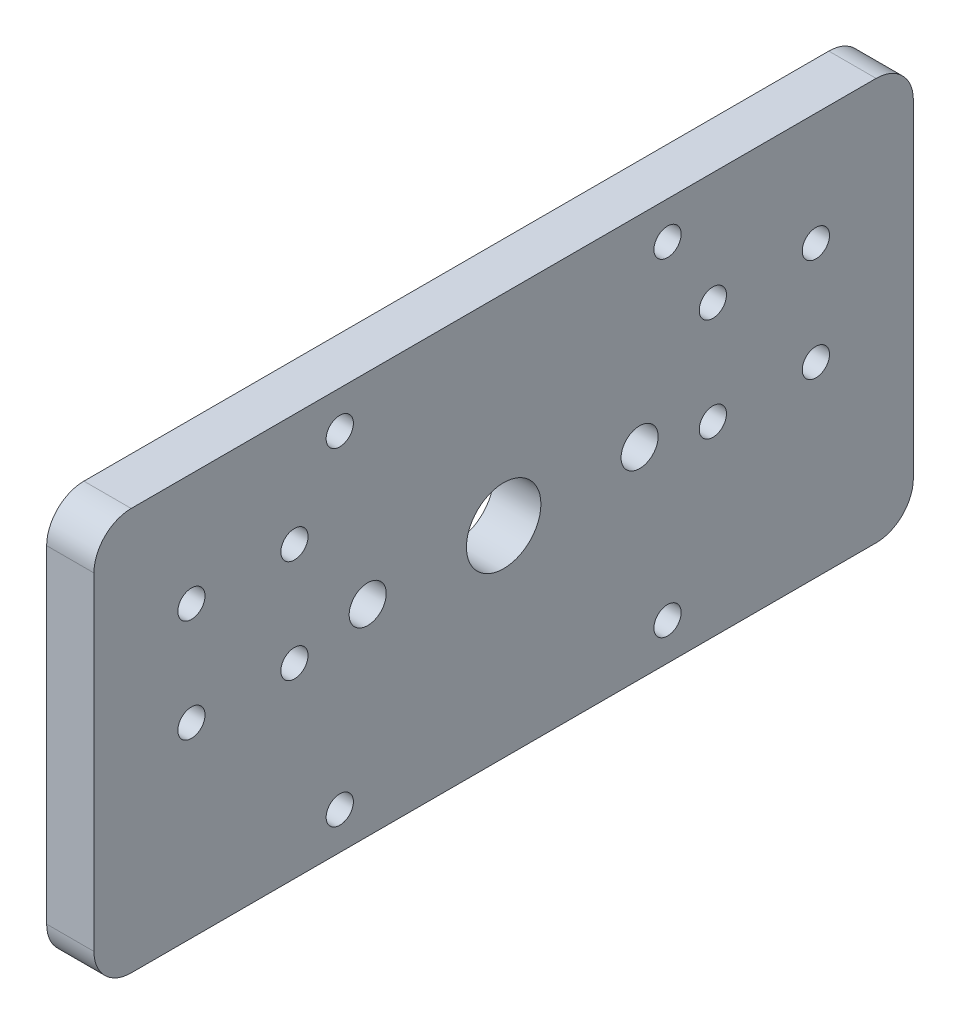
ISO-10303-21;
HEADER;
FILE_DESCRIPTION(('STEP AP214'),'2;1');
FILE_NAME('part.step','',(''),(''),'','','');
FILE_SCHEMA(('AUTOMOTIVE_DESIGN { 1 0 10303 214 1 1 1 1 }'));
ENDSEC;
DATA;
#1=APPLICATION_CONTEXT('core data for automotive mechanical design processes');
#2=APPLICATION_PROTOCOL_DEFINITION('international standard','automotive_design',2000,#1);
#3=PRODUCT_CONTEXT('',#1,'mechanical');
#4=PRODUCT('Part','Part','',(#3));
#5=PRODUCT_RELATED_PRODUCT_CATEGORY('part','',(#4));
#6=PRODUCT_DEFINITION_FORMATION('','',#4);
#7=PRODUCT_DEFINITION_CONTEXT('part definition',#1,'design');
#8=PRODUCT_DEFINITION('design','',#6,#7);
#9=PRODUCT_DEFINITION_SHAPE('','',#8);
#10=(LENGTH_UNIT() NAMED_UNIT(*) SI_UNIT(.MILLI.,.METRE.));
#11=(NAMED_UNIT(*) PLANE_ANGLE_UNIT() SI_UNIT($,.RADIAN.));
#12=(NAMED_UNIT(*) SI_UNIT($,.STERADIAN.) SOLID_ANGLE_UNIT());
#13=UNCERTAINTY_MEASURE_WITH_UNIT(LENGTH_MEASURE(1.E-05),#10,'distance_accuracy_value','');
#14=(GEOMETRIC_REPRESENTATION_CONTEXT(3) GLOBAL_UNCERTAINTY_ASSIGNED_CONTEXT((#13)) GLOBAL_UNIT_ASSIGNED_CONTEXT((#10,
#11,#12)) REPRESENTATION_CONTEXT('',''));
#15=CARTESIAN_POINT('',(0.,0.,0.));
#16=DIRECTION('',(0.,0.,1.));
#17=DIRECTION('',(1.,0.,0.));
#18=AXIS2_PLACEMENT_3D('',#15,#16,#17);
#19=CARTESIAN_POINT('',(6.35,-27.,-55.));
#20=DIRECTION('',(0.,0.,1.));
#21=DIRECTION('',(1.,0.,0.));
#22=AXIS2_PLACEMENT_3D('',#19,#20,#21);
#23=PLANE('',#22);
#24=DIRECTION('',(0.,1.,0.));
#25=VECTOR('',#24,1.);
#26=CARTESIAN_POINT('',(6.35,-27.,-55.));
#27=LINE('',#26,#25);
#28=CARTESIAN_POINT('',(6.35,-22.,-55.));
#29=VERTEX_POINT('',#28);
#30=CARTESIAN_POINT('',(6.35,22.,-55.));
#31=VERTEX_POINT('',#30);
#32=EDGE_CURVE('E118',#29,#31,#27,.T.);
#33=ORIENTED_EDGE('',*,*,#32,.F.);
#34=DIRECTION('',(-1.,0.,0.));
#35=VECTOR('',#34,1.);
#36=CARTESIAN_POINT('',(6.35,-22.,-55.));
#37=LINE('',#36,#35);
#38=CARTESIAN_POINT('',(0.,-22.,-55.));
#39=VERTEX_POINT('',#38);
#40=EDGE_CURVE('E103',#29,#39,#37,.T.);
#41=ORIENTED_EDGE('',*,*,#40,.T.);
#42=DIRECTION('',(0.,1.,0.));
#43=VECTOR('',#42,1.);
#44=CARTESIAN_POINT('',(0.,-27.,-55.));
#45=LINE('',#44,#43);
#46=CARTESIAN_POINT('',(0.,22.,-55.));
#47=VERTEX_POINT('',#46);
#48=EDGE_CURVE('E115',#39,#47,#45,.T.);
#49=ORIENTED_EDGE('',*,*,#48,.T.);
#50=DIRECTION('',(-1.,0.,0.));
#51=VECTOR('',#50,1.);
#52=CARTESIAN_POINT('',(6.35,22.,-55.));
#53=LINE('',#52,#51);
#54=EDGE_CURVE('E120',#47,#31,#53,.F.);
#55=ORIENTED_EDGE('',*,*,#54,.T.);
#56=EDGE_LOOP('',(#33,#41,#49,#55));
#57=FACE_BOUND('',#56,.T.);
#58=ADVANCED_FACE('F32',(#57),#23,.F.);
#59=CARTESIAN_POINT('',(6.35,27.,55.));
#60=DIRECTION('',(0.,-1.,0.));
#61=DIRECTION('',(0.,0.,-1.));
#62=AXIS2_PLACEMENT_3D('',#59,#60,#61);
#63=PLANE('',#62);
#64=DIRECTION('',(0.,0.,1.));
#65=VECTOR('',#64,1.);
#66=CARTESIAN_POINT('',(6.35,27.,55.));
#67=LINE('',#66,#65);
#68=CARTESIAN_POINT('',(6.35,27.,-50.));
#69=VERTEX_POINT('',#68);
#70=CARTESIAN_POINT('',(6.35,27.,50.));
#71=VERTEX_POINT('',#70);
#72=EDGE_CURVE('E162',#69,#71,#67,.T.);
#73=ORIENTED_EDGE('',*,*,#72,.F.);
#74=DIRECTION('',(-1.,0.,0.));
#75=VECTOR('',#74,1.);
#76=CARTESIAN_POINT('',(6.35,27.,-50.));
#77=LINE('',#76,#75);
#78=CARTESIAN_POINT('',(0.,27.,-50.));
#79=VERTEX_POINT('',#78);
#80=EDGE_CURVE('E11',#69,#79,#77,.T.);
#81=ORIENTED_EDGE('',*,*,#80,.T.);
#82=DIRECTION('',(0.,0.,1.));
#83=VECTOR('',#82,1.);
#84=CARTESIAN_POINT('',(0.,27.,55.));
#85=LINE('',#84,#83);
#86=CARTESIAN_POINT('',(0.,27.,50.));
#87=VERTEX_POINT('',#86);
#88=EDGE_CURVE('E125',#79,#87,#85,.T.);
#89=ORIENTED_EDGE('',*,*,#88,.T.);
#90=DIRECTION('',(-1.,0.,0.));
#91=VECTOR('',#90,1.);
#92=CARTESIAN_POINT('',(6.35,27.,50.));
#93=LINE('',#92,#91);
#94=EDGE_CURVE('E40',#87,#71,#93,.F.);
#95=ORIENTED_EDGE('',*,*,#94,.T.);
#96=EDGE_LOOP('',(#73,#81,#89,#95));
#97=FACE_BOUND('',#96,.T.);
#98=ADVANCED_FACE('F161',(#97),#63,.F.);
#99=CARTESIAN_POINT('',(6.35,-27.,55.));
#100=DIRECTION('',(0.,0.,-1.));
#101=DIRECTION('',(-1.,0.,0.));
#102=AXIS2_PLACEMENT_3D('',#99,#100,#101);
#103=PLANE('',#102);
#104=DIRECTION('',(0.,-1.,0.));
#105=VECTOR('',#104,1.);
#106=CARTESIAN_POINT('',(0.,-27.,55.));
#107=LINE('',#106,#105);
#108=CARTESIAN_POINT('',(0.,22.,55.));
#109=VERTEX_POINT('',#108);
#110=CARTESIAN_POINT('',(0.,-22.,55.));
#111=VERTEX_POINT('',#110);
#112=EDGE_CURVE('E129',#109,#111,#107,.T.);
#113=ORIENTED_EDGE('',*,*,#112,.T.);
#114=DIRECTION('',(-1.,0.,0.));
#115=VECTOR('',#114,1.);
#116=CARTESIAN_POINT('',(6.35,-22.,55.));
#117=LINE('',#116,#115);
#118=CARTESIAN_POINT('',(6.35,-22.,55.));
#119=VERTEX_POINT('',#118);
#120=EDGE_CURVE('E47',#111,#119,#117,.F.);
#121=ORIENTED_EDGE('',*,*,#120,.T.);
#122=DIRECTION('',(0.,-1.,0.));
#123=VECTOR('',#122,1.);
#124=CARTESIAN_POINT('',(6.35,-27.,55.));
#125=LINE('',#124,#123);
#126=CARTESIAN_POINT('',(6.35,22.,55.));
#127=VERTEX_POINT('',#126);
#128=EDGE_CURVE('E168',#127,#119,#125,.T.);
#129=ORIENTED_EDGE('',*,*,#128,.F.);
#130=DIRECTION('',(-1.,0.,0.));
#131=VECTOR('',#130,1.);
#132=CARTESIAN_POINT('',(6.35,22.,55.));
#133=LINE('',#132,#131);
#134=EDGE_CURVE('E155',#127,#109,#133,.T.);
#135=ORIENTED_EDGE('',*,*,#134,.T.);
#136=EDGE_LOOP('',(#113,#121,#129,#135));
#137=FACE_BOUND('',#136,.T.);
#138=ADVANCED_FACE('F172',(#137),#103,.F.);
#139=CARTESIAN_POINT('',(6.35,-27.,55.));
#140=DIRECTION('',(0.,1.,0.));
#141=DIRECTION('',(0.,0.,1.));
#142=AXIS2_PLACEMENT_3D('',#139,#140,#141);
#143=PLANE('',#142);
#144=DIRECTION('',(0.,0.,-1.));
#145=VECTOR('',#144,1.);
#146=CARTESIAN_POINT('',(0.,-27.,55.));
#147=LINE('',#146,#145);
#148=CARTESIAN_POINT('',(0.,-27.,50.));
#149=VERTEX_POINT('',#148);
#150=CARTESIAN_POINT('',(0.,-27.,-50.));
#151=VERTEX_POINT('',#150);
#152=EDGE_CURVE('E139',#149,#151,#147,.T.);
#153=ORIENTED_EDGE('',*,*,#152,.T.);
#154=DIRECTION('',(-1.,0.,0.));
#155=VECTOR('',#154,1.);
#156=CARTESIAN_POINT('',(6.35,-27.,-50.));
#157=LINE('',#156,#155);
#158=CARTESIAN_POINT('',(6.35,-27.,-50.));
#159=VERTEX_POINT('',#158);
#160=EDGE_CURVE('E104',#151,#159,#157,.F.);
#161=ORIENTED_EDGE('',*,*,#160,.T.);
#162=DIRECTION('',(0.,0.,-1.));
#163=VECTOR('',#162,1.);
#164=CARTESIAN_POINT('',(6.35,-27.,55.));
#165=LINE('',#164,#163);
#166=CARTESIAN_POINT('',(6.35,-27.,50.));
#167=VERTEX_POINT('',#166);
#168=EDGE_CURVE('E135',#167,#159,#165,.T.);
#169=ORIENTED_EDGE('',*,*,#168,.F.);
#170=DIRECTION('',(-1.,0.,0.));
#171=VECTOR('',#170,1.);
#172=CARTESIAN_POINT('',(6.35,-27.,50.));
#173=LINE('',#172,#171);
#174=EDGE_CURVE('E109',#167,#149,#173,.T.);
#175=ORIENTED_EDGE('',*,*,#174,.T.);
#176=EDGE_LOOP('',(#153,#161,#169,#175));
#177=FACE_BOUND('',#176,.T.);
#178=ADVANCED_FACE('F179',(#177),#143,.F.);
#179=CARTESIAN_POINT('',(6.35,0.,0.));
#180=DIRECTION('',(-1.,0.,0.));
#181=DIRECTION('',(0.,0.,1.));
#182=AXIS2_PLACEMENT_3D('',#179,#180,#181);
#183=PLANE('',#182);
#184=CARTESIAN_POINT('',(6.35,0.,18.25));
#185=DIRECTION('',(-1.,0.,0.));
#186=DIRECTION('',(0.,0.,1.));
#187=AXIS2_PLACEMENT_3D('',#184,#185,#186);
#188=CIRCLE('',#187,2.4892);
#189=CARTESIAN_POINT('',(6.35,0.,20.7392));
#190=VERTEX_POINT('',#189);
#191=EDGE_CURVE('E262',#190,#190,#188,.T.);
#192=ORIENTED_EDGE('',*,*,#191,.T.);
#193=EDGE_LOOP('',(#192));
#194=FACE_BOUND('',#193,.T.);
#195=CARTESIAN_POINT('',(6.35,0.,-18.25));
#196=DIRECTION('',(-1.,0.,0.));
#197=DIRECTION('',(0.,0.,1.));
#198=AXIS2_PLACEMENT_3D('',#195,#196,#197);
#199=CIRCLE('',#198,2.4892);
#200=CARTESIAN_POINT('',(6.35,0.,-15.7608));
#201=VERTEX_POINT('',#200);
#202=EDGE_CURVE('E256',#201,#201,#199,.T.);
#203=ORIENTED_EDGE('',*,*,#202,.T.);
#204=EDGE_LOOP('',(#203));
#205=FACE_BOUND('',#204,.T.);
#206=CARTESIAN_POINT('',(6.35,11.8847972132232,41.9147972132232));
#207=DIRECTION('',(1.,0.,0.));
#208=DIRECTION('',(0.,0.,-1.));
#209=AXIS2_PLACEMENT_3D('',#206,#207,#208);
#210=CIRCLE('',#209,1.82879999999999);
#211=CARTESIAN_POINT('',(6.35,11.8847972132232,40.0859972132233));
#212=VERTEX_POINT('',#211);
#213=EDGE_CURVE('E253',#212,#212,#210,.T.);
#214=ORIENTED_EDGE('',*,*,#213,.F.);
#215=EDGE_LOOP('',(#214));
#216=FACE_BOUND('',#215,.T.);
#217=CARTESIAN_POINT('',(6.35,11.8847972132232,28.0852027867768));
#218=DIRECTION('',(1.,0.,0.));
#219=DIRECTION('',(0.,0.,-1.));
#220=AXIS2_PLACEMENT_3D('',#217,#218,#219);
#221=CIRCLE('',#220,1.82879999999999);
#222=CARTESIAN_POINT('',(6.35,11.8847972132232,26.2564027867768));
#223=VERTEX_POINT('',#222);
#224=EDGE_CURVE('E247',#223,#223,#221,.T.);
#225=ORIENTED_EDGE('',*,*,#224,.F.);
#226=EDGE_LOOP('',(#225));
#227=FACE_BOUND('',#226,.T.);
#228=CARTESIAN_POINT('',(6.35,-1.94479721322325,28.0852027867768));
#229=DIRECTION('',(1.,0.,0.));
#230=DIRECTION('',(0.,0.,-1.));
#231=AXIS2_PLACEMENT_3D('',#228,#229,#230);
#232=CIRCLE('',#231,1.82879999999999);
#233=CARTESIAN_POINT('',(6.35,-1.94479721322325,26.2564027867768));
#234=VERTEX_POINT('',#233);
#235=EDGE_CURVE('E241',#234,#234,#232,.T.);
#236=ORIENTED_EDGE('',*,*,#235,.F.);
#237=EDGE_LOOP('',(#236));
#238=FACE_BOUND('',#237,.T.);
#239=CARTESIAN_POINT('',(6.35,-1.94479721322325,41.9147972132232));
#240=DIRECTION('',(1.,0.,0.));
#241=DIRECTION('',(0.,0.,-1.));
#242=AXIS2_PLACEMENT_3D('',#239,#240,#241);
#243=CIRCLE('',#242,1.82879999999999);
#244=CARTESIAN_POINT('',(6.35,-1.94479721322325,40.0859972132233));
#245=VERTEX_POINT('',#244);
#246=EDGE_CURVE('E235',#245,#245,#243,.T.);
#247=ORIENTED_EDGE('',*,*,#246,.F.);
#248=EDGE_LOOP('',(#247));
#249=FACE_BOUND('',#248,.T.);
#250=CARTESIAN_POINT('',(6.35,11.8847972132232,-28.0852027867768));
#251=DIRECTION('',(1.,0.,0.));
#252=DIRECTION('',(0.,0.,-1.));
#253=AXIS2_PLACEMENT_3D('',#250,#251,#252);
#254=CIRCLE('',#253,1.82879999999999);
#255=CARTESIAN_POINT('',(6.35,11.8847972132232,-29.9140027867767));
#256=VERTEX_POINT('',#255);
#257=EDGE_CURVE('E229',#256,#256,#254,.T.);
#258=ORIENTED_EDGE('',*,*,#257,.F.);
#259=EDGE_LOOP('',(#258));
#260=FACE_BOUND('',#259,.T.);
#261=CARTESIAN_POINT('',(6.35,-1.94479721322325,-28.0852027867768));
#262=DIRECTION('',(1.,0.,0.));
#263=DIRECTION('',(0.,0.,-1.));
#264=AXIS2_PLACEMENT_3D('',#261,#262,#263);
#265=CIRCLE('',#264,1.82879999999999);
#266=CARTESIAN_POINT('',(6.35,-1.94479721322325,-29.9140027867767));
#267=VERTEX_POINT('',#266);
#268=EDGE_CURVE('E223',#267,#267,#265,.T.);
#269=ORIENTED_EDGE('',*,*,#268,.F.);
#270=EDGE_LOOP('',(#269));
#271=FACE_BOUND('',#270,.T.);
#272=CARTESIAN_POINT('',(6.35,-1.94479721322325,-41.9147972132233));
#273=DIRECTION('',(1.,0.,0.));
#274=DIRECTION('',(0.,0.,-1.));
#275=AXIS2_PLACEMENT_3D('',#272,#273,#274);
#276=CIRCLE('',#275,1.82879999999999);
#277=CARTESIAN_POINT('',(6.35,-1.94479721322325,-43.7435972132232));
#278=VERTEX_POINT('',#277);
#279=EDGE_CURVE('E217',#278,#278,#276,.T.);
#280=ORIENTED_EDGE('',*,*,#279,.F.);
#281=EDGE_LOOP('',(#280));
#282=FACE_BOUND('',#281,.T.);
#283=CARTESIAN_POINT('',(6.35,11.8847972132233,-41.9147972132233));
#284=DIRECTION('',(1.,0.,0.));
#285=DIRECTION('',(0.,0.,-1.));
#286=AXIS2_PLACEMENT_3D('',#283,#284,#285);
#287=CIRCLE('',#286,1.82879999999999);
#288=CARTESIAN_POINT('',(6.35,11.8847972132233,-43.7435972132232));
#289=VERTEX_POINT('',#288);
#290=EDGE_CURVE('E211',#289,#289,#287,.T.);
#291=ORIENTED_EDGE('',*,*,#290,.F.);
#292=EDGE_LOOP('',(#291));
#293=FACE_BOUND('',#292,.T.);
#294=CARTESIAN_POINT('',(6.35,0.,0.));
#295=DIRECTION('',(1.,0.,0.));
#296=DIRECTION('',(0.,0.,-1.));
#297=AXIS2_PLACEMENT_3D('',#294,#295,#296);
#298=CIRCLE('',#297,5.);
#299=CARTESIAN_POINT('',(6.35,0.,-5.));
#300=VERTEX_POINT('',#299);
#301=EDGE_CURVE('E203',#300,#300,#298,.T.);
#302=ORIENTED_EDGE('',*,*,#301,.F.);
#303=EDGE_LOOP('',(#302));
#304=FACE_BOUND('',#303,.T.);
#305=CARTESIAN_POINT('',(6.35,22.,22.));
#306=DIRECTION('',(1.,0.,0.));
#307=DIRECTION('',(0.,0.,-1.));
#308=AXIS2_PLACEMENT_3D('',#305,#306,#307);
#309=CIRCLE('',#308,1.82879999999999);
#310=CARTESIAN_POINT('',(6.35,22.,20.1712));
#311=VERTEX_POINT('',#310);
#312=EDGE_CURVE('E199',#311,#311,#309,.T.);
#313=ORIENTED_EDGE('',*,*,#312,.F.);
#314=EDGE_LOOP('',(#313));
#315=FACE_BOUND('',#314,.T.);
#316=CARTESIAN_POINT('',(6.35,22.,-22.));
#317=DIRECTION('',(1.,0.,0.));
#318=DIRECTION('',(0.,0.,-1.));
#319=AXIS2_PLACEMENT_3D('',#316,#317,#318);
#320=CIRCLE('',#319,1.82879999999999);
#321=CARTESIAN_POINT('',(6.35,22.,-23.8288));
#322=VERTEX_POINT('',#321);
#323=EDGE_CURVE('E193',#322,#322,#320,.T.);
#324=ORIENTED_EDGE('',*,*,#323,.F.);
#325=EDGE_LOOP('',(#324));
#326=FACE_BOUND('',#325,.T.);
#327=CARTESIAN_POINT('',(6.35,-22.,-22.));
#328=DIRECTION('',(1.,0.,0.));
#329=DIRECTION('',(0.,0.,-1.));
#330=AXIS2_PLACEMENT_3D('',#327,#328,#329);
#331=CIRCLE('',#330,1.82879999999999);
#332=CARTESIAN_POINT('',(6.35,-22.,-23.8288));
#333=VERTEX_POINT('',#332);
#334=EDGE_CURVE('E187',#333,#333,#331,.T.);
#335=ORIENTED_EDGE('',*,*,#334,.F.);
#336=EDGE_LOOP('',(#335));
#337=FACE_BOUND('',#336,.T.);
#338=CARTESIAN_POINT('',(6.35,-22.,22.));
#339=DIRECTION('',(1.,0.,0.));
#340=DIRECTION('',(0.,0.,-1.));
#341=AXIS2_PLACEMENT_3D('',#338,#339,#340);
#342=CIRCLE('',#341,1.82879999999999);
#343=CARTESIAN_POINT('',(6.35,-22.,20.1712));
#344=VERTEX_POINT('',#343);
#345=EDGE_CURVE('E132',#344,#344,#342,.T.);
#346=ORIENTED_EDGE('',*,*,#345,.F.);
#347=EDGE_LOOP('',(#346));
#348=FACE_BOUND('',#347,.T.);
#349=ORIENTED_EDGE('',*,*,#168,.T.);
#350=CARTESIAN_POINT('',(6.35,-22.,-50.));
#351=DIRECTION('',(-1.,0.,0.));
#352=DIRECTION('',(0.,0.,1.));
#353=AXIS2_PLACEMENT_3D('',#350,#351,#352);
#354=CIRCLE('',#353,5.);
#355=EDGE_CURVE('E153',#159,#29,#354,.F.);
#356=ORIENTED_EDGE('',*,*,#355,.T.);
#357=ORIENTED_EDGE('',*,*,#32,.T.);
#358=CARTESIAN_POINT('',(6.35,22.,-50.));
#359=DIRECTION('',(-1.,0.,0.));
#360=DIRECTION('',(0.,0.,1.));
#361=AXIS2_PLACEMENT_3D('',#358,#359,#360);
#362=CIRCLE('',#361,5.);
#363=EDGE_CURVE('E149',#31,#69,#362,.F.);
#364=ORIENTED_EDGE('',*,*,#363,.T.);
#365=ORIENTED_EDGE('',*,*,#72,.T.);
#366=CARTESIAN_POINT('',(6.35,22.,50.));
#367=DIRECTION('',(-1.,0.,0.));
#368=DIRECTION('',(0.,0.,1.));
#369=AXIS2_PLACEMENT_3D('',#366,#367,#368);
#370=CIRCLE('',#369,5.);
#371=EDGE_CURVE('E54',#71,#127,#370,.F.);
#372=ORIENTED_EDGE('',*,*,#371,.T.);
#373=ORIENTED_EDGE('',*,*,#128,.T.);
#374=CARTESIAN_POINT('',(6.35,-22.,50.));
#375=DIRECTION('',(-1.,0.,0.));
#376=DIRECTION('',(0.,0.,1.));
#377=AXIS2_PLACEMENT_3D('',#374,#375,#376);
#378=CIRCLE('',#377,5.);
#379=EDGE_CURVE('E151',#119,#167,#378,.F.);
#380=ORIENTED_EDGE('',*,*,#379,.T.);
#381=EDGE_LOOP('',(#349,#356,#357,#364,#365,#372,#373,#380));
#382=FACE_BOUND('',#381,.T.);
#383=ADVANCED_FACE('F166',(#194,#205,#216,#227,#238,#249,#260,#271,#282,#293,#304,#315,#326,
#337,#348,#382),#183,.F.);
#384=CARTESIAN_POINT('',(0.,0.,0.));
#385=DIRECTION('',(-1.,0.,0.));
#386=DIRECTION('',(0.,0.,1.));
#387=AXIS2_PLACEMENT_3D('',#384,#385,#386);
#388=PLANE('',#387);
#389=CARTESIAN_POINT('',(0.,0.,18.25));
#390=DIRECTION('',(-1.,0.,0.));
#391=DIRECTION('',(0.,0.,1.));
#392=AXIS2_PLACEMENT_3D('',#389,#390,#391);
#393=CIRCLE('',#392,2.4892);
#394=CARTESIAN_POINT('',(0.,0.,20.7392));
#395=VERTEX_POINT('',#394);
#396=EDGE_CURVE('E265',#395,#395,#393,.T.);
#397=ORIENTED_EDGE('',*,*,#396,.F.);
#398=EDGE_LOOP('',(#397));
#399=FACE_BOUND('',#398,.T.);
#400=CARTESIAN_POINT('',(0.,0.,-18.25));
#401=DIRECTION('',(-1.,0.,0.));
#402=DIRECTION('',(0.,0.,1.));
#403=AXIS2_PLACEMENT_3D('',#400,#401,#402);
#404=CIRCLE('',#403,2.4892);
#405=CARTESIAN_POINT('',(0.,0.,-15.7608));
#406=VERTEX_POINT('',#405);
#407=EDGE_CURVE('E259',#406,#406,#404,.T.);
#408=ORIENTED_EDGE('',*,*,#407,.F.);
#409=EDGE_LOOP('',(#408));
#410=FACE_BOUND('',#409,.T.);
#411=CARTESIAN_POINT('',(0.,11.8847972132232,41.9147972132232));
#412=DIRECTION('',(1.,0.,0.));
#413=DIRECTION('',(0.,0.,-1.));
#414=AXIS2_PLACEMENT_3D('',#411,#412,#413);
#415=CIRCLE('',#414,1.82879999999999);
#416=CARTESIAN_POINT('',(0.,11.8847972132232,40.0859972132233));
#417=VERTEX_POINT('',#416);
#418=EDGE_CURVE('E250',#417,#417,#415,.T.);
#419=ORIENTED_EDGE('',*,*,#418,.T.);
#420=EDGE_LOOP('',(#419));
#421=FACE_BOUND('',#420,.T.);
#422=CARTESIAN_POINT('',(0.,11.8847972132232,28.0852027867768));
#423=DIRECTION('',(1.,0.,0.));
#424=DIRECTION('',(0.,0.,-1.));
#425=AXIS2_PLACEMENT_3D('',#422,#423,#424);
#426=CIRCLE('',#425,1.82879999999999);
#427=CARTESIAN_POINT('',(0.,11.8847972132232,26.2564027867768));
#428=VERTEX_POINT('',#427);
#429=EDGE_CURVE('E244',#428,#428,#426,.T.);
#430=ORIENTED_EDGE('',*,*,#429,.T.);
#431=EDGE_LOOP('',(#430));
#432=FACE_BOUND('',#431,.T.);
#433=CARTESIAN_POINT('',(0.,-1.94479721322325,28.0852027867768));
#434=DIRECTION('',(1.,0.,0.));
#435=DIRECTION('',(0.,0.,-1.));
#436=AXIS2_PLACEMENT_3D('',#433,#434,#435);
#437=CIRCLE('',#436,1.82879999999999);
#438=CARTESIAN_POINT('',(0.,-1.94479721322325,26.2564027867768));
#439=VERTEX_POINT('',#438);
#440=EDGE_CURVE('E238',#439,#439,#437,.T.);
#441=ORIENTED_EDGE('',*,*,#440,.T.);
#442=EDGE_LOOP('',(#441));
#443=FACE_BOUND('',#442,.T.);
#444=CARTESIAN_POINT('',(0.,-1.94479721322325,41.9147972132232));
#445=DIRECTION('',(1.,0.,0.));
#446=DIRECTION('',(0.,0.,-1.));
#447=AXIS2_PLACEMENT_3D('',#444,#445,#446);
#448=CIRCLE('',#447,1.82879999999999);
#449=CARTESIAN_POINT('',(0.,-1.94479721322325,40.0859972132233));
#450=VERTEX_POINT('',#449);
#451=EDGE_CURVE('E232',#450,#450,#448,.T.);
#452=ORIENTED_EDGE('',*,*,#451,.T.);
#453=EDGE_LOOP('',(#452));
#454=FACE_BOUND('',#453,.T.);
#455=CARTESIAN_POINT('',(0.,11.8847972132232,-28.0852027867768));
#456=DIRECTION('',(1.,0.,0.));
#457=DIRECTION('',(0.,0.,-1.));
#458=AXIS2_PLACEMENT_3D('',#455,#456,#457);
#459=CIRCLE('',#458,1.82879999999999);
#460=CARTESIAN_POINT('',(0.,11.8847972132232,-29.9140027867767));
#461=VERTEX_POINT('',#460);
#462=EDGE_CURVE('E226',#461,#461,#459,.T.);
#463=ORIENTED_EDGE('',*,*,#462,.T.);
#464=EDGE_LOOP('',(#463));
#465=FACE_BOUND('',#464,.T.);
#466=CARTESIAN_POINT('',(0.,-1.94479721322325,-28.0852027867768));
#467=DIRECTION('',(1.,0.,0.));
#468=DIRECTION('',(0.,0.,-1.));
#469=AXIS2_PLACEMENT_3D('',#466,#467,#468);
#470=CIRCLE('',#469,1.82879999999999);
#471=CARTESIAN_POINT('',(0.,-1.94479721322325,-29.9140027867767));
#472=VERTEX_POINT('',#471);
#473=EDGE_CURVE('E220',#472,#472,#470,.T.);
#474=ORIENTED_EDGE('',*,*,#473,.T.);
#475=EDGE_LOOP('',(#474));
#476=FACE_BOUND('',#475,.T.);
#477=CARTESIAN_POINT('',(0.,-1.94479721322325,-41.9147972132233));
#478=DIRECTION('',(1.,0.,0.));
#479=DIRECTION('',(0.,0.,-1.));
#480=AXIS2_PLACEMENT_3D('',#477,#478,#479);
#481=CIRCLE('',#480,1.82879999999999);
#482=CARTESIAN_POINT('',(0.,-1.94479721322325,-43.7435972132232));
#483=VERTEX_POINT('',#482);
#484=EDGE_CURVE('E214',#483,#483,#481,.T.);
#485=ORIENTED_EDGE('',*,*,#484,.T.);
#486=EDGE_LOOP('',(#485));
#487=FACE_BOUND('',#486,.T.);
#488=CARTESIAN_POINT('',(0.,11.8847972132233,-41.9147972132233));
#489=DIRECTION('',(1.,0.,0.));
#490=DIRECTION('',(0.,0.,-1.));
#491=AXIS2_PLACEMENT_3D('',#488,#489,#490);
#492=CIRCLE('',#491,1.82879999999999);
#493=CARTESIAN_POINT('',(0.,11.8847972132233,-43.7435972132232));
#494=VERTEX_POINT('',#493);
#495=EDGE_CURVE('E206',#494,#494,#492,.T.);
#496=ORIENTED_EDGE('',*,*,#495,.T.);
#497=EDGE_LOOP('',(#496));
#498=FACE_BOUND('',#497,.T.);
#499=CARTESIAN_POINT('',(0.,0.,0.));
#500=DIRECTION('',(1.,0.,0.));
#501=DIRECTION('',(0.,0.,-1.));
#502=AXIS2_PLACEMENT_3D('',#499,#500,#501);
#503=CIRCLE('',#502,5.);
#504=CARTESIAN_POINT('',(0.,0.,-5.));
#505=VERTEX_POINT('',#504);
#506=EDGE_CURVE('E202',#505,#505,#503,.T.);
#507=ORIENTED_EDGE('',*,*,#506,.T.);
#508=EDGE_LOOP('',(#507));
#509=FACE_BOUND('',#508,.T.);
#510=CARTESIAN_POINT('',(0.,22.,22.));
#511=DIRECTION('',(1.,0.,0.));
#512=DIRECTION('',(0.,0.,-1.));
#513=AXIS2_PLACEMENT_3D('',#510,#511,#512);
#514=CIRCLE('',#513,1.82879999999999);
#515=CARTESIAN_POINT('',(0.,22.,20.1712));
#516=VERTEX_POINT('',#515);
#517=EDGE_CURVE('E196',#516,#516,#514,.T.);
#518=ORIENTED_EDGE('',*,*,#517,.T.);
#519=EDGE_LOOP('',(#518));
#520=FACE_BOUND('',#519,.T.);
#521=CARTESIAN_POINT('',(0.,22.,-22.));
#522=DIRECTION('',(1.,0.,0.));
#523=DIRECTION('',(0.,0.,-1.));
#524=AXIS2_PLACEMENT_3D('',#521,#522,#523);
#525=CIRCLE('',#524,1.82879999999999);
#526=CARTESIAN_POINT('',(0.,22.,-23.8288));
#527=VERTEX_POINT('',#526);
#528=EDGE_CURVE('E190',#527,#527,#525,.T.);
#529=ORIENTED_EDGE('',*,*,#528,.T.);
#530=EDGE_LOOP('',(#529));
#531=FACE_BOUND('',#530,.T.);
#532=CARTESIAN_POINT('',(0.,-22.,-22.));
#533=DIRECTION('',(1.,0.,0.));
#534=DIRECTION('',(0.,0.,-1.));
#535=AXIS2_PLACEMENT_3D('',#532,#533,#534);
#536=CIRCLE('',#535,1.82879999999999);
#537=CARTESIAN_POINT('',(0.,-22.,-23.8288));
#538=VERTEX_POINT('',#537);
#539=EDGE_CURVE('E184',#538,#538,#536,.T.);
#540=ORIENTED_EDGE('',*,*,#539,.T.);
#541=EDGE_LOOP('',(#540));
#542=FACE_BOUND('',#541,.T.);
#543=CARTESIAN_POINT('',(0.,-22.,22.));
#544=DIRECTION('',(1.,0.,0.));
#545=DIRECTION('',(0.,0.,-1.));
#546=AXIS2_PLACEMENT_3D('',#543,#544,#545);
#547=CIRCLE('',#546,1.82879999999999);
#548=CARTESIAN_POINT('',(0.,-22.,20.1712));
#549=VERTEX_POINT('',#548);
#550=EDGE_CURVE('E126',#549,#549,#547,.T.);
#551=ORIENTED_EDGE('',*,*,#550,.T.);
#552=EDGE_LOOP('',(#551));
#553=FACE_BOUND('',#552,.T.);
#554=ORIENTED_EDGE('',*,*,#48,.F.);
#555=CARTESIAN_POINT('',(0.,-22.,-50.));
#556=DIRECTION('',(-1.,0.,0.));
#557=DIRECTION('',(0.,0.,1.));
#558=AXIS2_PLACEMENT_3D('',#555,#556,#557);
#559=CIRCLE('',#558,5.);
#560=EDGE_CURVE('E99',#39,#151,#559,.T.);
#561=ORIENTED_EDGE('',*,*,#560,.T.);
#562=ORIENTED_EDGE('',*,*,#152,.F.);
#563=CARTESIAN_POINT('',(0.,-22.,50.));
#564=DIRECTION('',(-1.,0.,0.));
#565=DIRECTION('',(0.,0.,1.));
#566=AXIS2_PLACEMENT_3D('',#563,#564,#565);
#567=CIRCLE('',#566,5.);
#568=EDGE_CURVE('E110',#149,#111,#567,.T.);
#569=ORIENTED_EDGE('',*,*,#568,.T.);
#570=ORIENTED_EDGE('',*,*,#112,.F.);
#571=CARTESIAN_POINT('',(0.,22.,50.));
#572=DIRECTION('',(-1.,0.,0.));
#573=DIRECTION('',(0.,0.,1.));
#574=AXIS2_PLACEMENT_3D('',#571,#572,#573);
#575=CIRCLE('',#574,5.);
#576=EDGE_CURVE('E119',#109,#87,#575,.T.);
#577=ORIENTED_EDGE('',*,*,#576,.T.);
#578=ORIENTED_EDGE('',*,*,#88,.F.);
#579=CARTESIAN_POINT('',(0.,22.,-50.));
#580=DIRECTION('',(-1.,0.,0.));
#581=DIRECTION('',(0.,0.,1.));
#582=AXIS2_PLACEMENT_3D('',#579,#580,#581);
#583=CIRCLE('',#582,5.);
#584=EDGE_CURVE('E124',#79,#47,#583,.T.);
#585=ORIENTED_EDGE('',*,*,#584,.T.);
#586=EDGE_LOOP('',(#554,#561,#562,#569,#570,#577,#578,#585));
#587=FACE_BOUND('',#586,.T.);
#588=ADVANCED_FACE('F122',(#399,#410,#421,#432,#443,#454,#465,#476,#487,#498,#509,#520,#531,
#542,#553,#587),#388,.T.);
#589=CARTESIAN_POINT('',(6.35,-22.,-50.));
#590=DIRECTION('',(-1.,0.,0.));
#591=DIRECTION('',(0.,0.,1.));
#592=AXIS2_PLACEMENT_3D('',#589,#590,#591);
#593=CYLINDRICAL_SURFACE('',#592,5.);
#594=ORIENTED_EDGE('',*,*,#355,.F.);
#595=ORIENTED_EDGE('',*,*,#160,.F.);
#596=ORIENTED_EDGE('',*,*,#560,.F.);
#597=ORIENTED_EDGE('',*,*,#40,.F.);
#598=EDGE_LOOP('',(#594,#595,#596,#597));
#599=FACE_BOUND('',#598,.T.);
#600=ADVANCED_FACE('F102',(#599),#593,.T.);
#601=CARTESIAN_POINT('',(6.35,-22.,50.));
#602=DIRECTION('',(-1.,0.,0.));
#603=DIRECTION('',(0.,0.,1.));
#604=AXIS2_PLACEMENT_3D('',#601,#602,#603);
#605=CYLINDRICAL_SURFACE('',#604,5.);
#606=ORIENTED_EDGE('',*,*,#379,.F.);
#607=ORIENTED_EDGE('',*,*,#120,.F.);
#608=ORIENTED_EDGE('',*,*,#568,.F.);
#609=ORIENTED_EDGE('',*,*,#174,.F.);
#610=EDGE_LOOP('',(#606,#607,#608,#609));
#611=FACE_BOUND('',#610,.T.);
#612=ADVANCED_FACE('F176',(#611),#605,.T.);
#613=CARTESIAN_POINT('',(6.35,22.,-50.));
#614=DIRECTION('',(-1.,0.,0.));
#615=DIRECTION('',(0.,0.,1.));
#616=AXIS2_PLACEMENT_3D('',#613,#614,#615);
#617=CYLINDRICAL_SURFACE('',#616,5.);
#618=ORIENTED_EDGE('',*,*,#363,.F.);
#619=ORIENTED_EDGE('',*,*,#54,.F.);
#620=ORIENTED_EDGE('',*,*,#584,.F.);
#621=ORIENTED_EDGE('',*,*,#80,.F.);
#622=EDGE_LOOP('',(#618,#619,#620,#621));
#623=FACE_BOUND('',#622,.T.);
#624=ADVANCED_FACE('F329',(#623),#617,.T.);
#625=CARTESIAN_POINT('',(6.35,22.,50.));
#626=DIRECTION('',(-1.,0.,0.));
#627=DIRECTION('',(0.,0.,1.));
#628=AXIS2_PLACEMENT_3D('',#625,#626,#627);
#629=CYLINDRICAL_SURFACE('',#628,5.);
#630=ORIENTED_EDGE('',*,*,#371,.F.);
#631=ORIENTED_EDGE('',*,*,#94,.F.);
#632=ORIENTED_EDGE('',*,*,#576,.F.);
#633=ORIENTED_EDGE('',*,*,#134,.F.);
#634=EDGE_LOOP('',(#630,#631,#632,#633));
#635=FACE_BOUND('',#634,.T.);
#636=ADVANCED_FACE('F34',(#635),#629,.T.);
#637=CARTESIAN_POINT('',(6.35,-22.,22.));
#638=DIRECTION('',(1.,0.,0.));
#639=DIRECTION('',(0.,0.,-1.));
#640=AXIS2_PLACEMENT_3D('',#637,#638,#639);
#641=CYLINDRICAL_SURFACE('',#640,1.82879999999999);
#642=ORIENTED_EDGE('',*,*,#550,.F.);
#643=EDGE_LOOP('',(#642));
#644=FACE_BOUND('',#643,.T.);
#645=ORIENTED_EDGE('',*,*,#345,.T.);
#646=EDGE_LOOP('',(#645));
#647=FACE_BOUND('',#646,.T.);
#648=ADVANCED_FACE('F302',(#644,#647),#641,.F.);
#649=CARTESIAN_POINT('',(6.35,-22.,-22.));
#650=DIRECTION('',(1.,0.,0.));
#651=DIRECTION('',(0.,0.,-1.));
#652=AXIS2_PLACEMENT_3D('',#649,#650,#651);
#653=CYLINDRICAL_SURFACE('',#652,1.82879999999999);
#654=ORIENTED_EDGE('',*,*,#539,.F.);
#655=EDGE_LOOP('',(#654));
#656=FACE_BOUND('',#655,.T.);
#657=ORIENTED_EDGE('',*,*,#334,.T.);
#658=EDGE_LOOP('',(#657));
#659=FACE_BOUND('',#658,.T.);
#660=ADVANCED_FACE('F305',(#656,#659),#653,.F.);
#661=CARTESIAN_POINT('',(6.35,22.,-22.));
#662=DIRECTION('',(1.,0.,0.));
#663=DIRECTION('',(0.,0.,-1.));
#664=AXIS2_PLACEMENT_3D('',#661,#662,#663);
#665=CYLINDRICAL_SURFACE('',#664,1.82879999999999);
#666=ORIENTED_EDGE('',*,*,#528,.F.);
#667=EDGE_LOOP('',(#666));
#668=FACE_BOUND('',#667,.T.);
#669=ORIENTED_EDGE('',*,*,#323,.T.);
#670=EDGE_LOOP('',(#669));
#671=FACE_BOUND('',#670,.T.);
#672=ADVANCED_FACE('F347',(#668,#671),#665,.F.);
#673=CARTESIAN_POINT('',(6.35,22.,22.));
#674=DIRECTION('',(1.,0.,0.));
#675=DIRECTION('',(0.,0.,-1.));
#676=AXIS2_PLACEMENT_3D('',#673,#674,#675);
#677=CYLINDRICAL_SURFACE('',#676,1.82879999999999);
#678=ORIENTED_EDGE('',*,*,#517,.F.);
#679=EDGE_LOOP('',(#678));
#680=FACE_BOUND('',#679,.T.);
#681=ORIENTED_EDGE('',*,*,#312,.T.);
#682=EDGE_LOOP('',(#681));
#683=FACE_BOUND('',#682,.T.);
#684=ADVANCED_FACE('F355',(#680,#683),#677,.F.);
#685=CARTESIAN_POINT('',(0.,0.,0.));
#686=DIRECTION('',(1.,0.,0.));
#687=DIRECTION('',(0.,0.,-1.));
#688=AXIS2_PLACEMENT_3D('',#685,#686,#687);
#689=CYLINDRICAL_SURFACE('',#688,5.);
#690=ORIENTED_EDGE('',*,*,#506,.F.);
#691=EDGE_LOOP('',(#690));
#692=FACE_BOUND('',#691,.T.);
#693=ORIENTED_EDGE('',*,*,#301,.T.);
#694=EDGE_LOOP('',(#693));
#695=FACE_BOUND('',#694,.T.);
#696=ADVANCED_FACE('F363',(#692,#695),#689,.F.);
#697=CARTESIAN_POINT('',(6.35,11.8847972132233,-41.9147972132233));
#698=DIRECTION('',(1.,0.,0.));
#699=DIRECTION('',(0.,0.,-1.));
#700=AXIS2_PLACEMENT_3D('',#697,#698,#699);
#701=CYLINDRICAL_SURFACE('',#700,1.82879999999999);
#702=ORIENTED_EDGE('',*,*,#495,.F.);
#703=EDGE_LOOP('',(#702));
#704=FACE_BOUND('',#703,.T.);
#705=ORIENTED_EDGE('',*,*,#290,.T.);
#706=EDGE_LOOP('',(#705));
#707=FACE_BOUND('',#706,.T.);
#708=ADVANCED_FACE('F371',(#704,#707),#701,.F.);
#709=CARTESIAN_POINT('',(6.35,-1.94479721322325,-41.9147972132233));
#710=DIRECTION('',(1.,0.,0.));
#711=DIRECTION('',(0.,0.,-1.));
#712=AXIS2_PLACEMENT_3D('',#709,#710,#711);
#713=CYLINDRICAL_SURFACE('',#712,1.82879999999999);
#714=ORIENTED_EDGE('',*,*,#484,.F.);
#715=EDGE_LOOP('',(#714));
#716=FACE_BOUND('',#715,.T.);
#717=ORIENTED_EDGE('',*,*,#279,.T.);
#718=EDGE_LOOP('',(#717));
#719=FACE_BOUND('',#718,.T.);
#720=ADVANCED_FACE('F379',(#716,#719),#713,.F.);
#721=CARTESIAN_POINT('',(6.35,-1.94479721322325,-28.0852027867768));
#722=DIRECTION('',(1.,0.,0.));
#723=DIRECTION('',(0.,0.,-1.));
#724=AXIS2_PLACEMENT_3D('',#721,#722,#723);
#725=CYLINDRICAL_SURFACE('',#724,1.82879999999999);
#726=ORIENTED_EDGE('',*,*,#473,.F.);
#727=EDGE_LOOP('',(#726));
#728=FACE_BOUND('',#727,.T.);
#729=ORIENTED_EDGE('',*,*,#268,.T.);
#730=EDGE_LOOP('',(#729));
#731=FACE_BOUND('',#730,.T.);
#732=ADVANCED_FACE('F387',(#728,#731),#725,.F.);
#733=CARTESIAN_POINT('',(6.35,11.8847972132232,-28.0852027867768));
#734=DIRECTION('',(1.,0.,0.));
#735=DIRECTION('',(0.,0.,-1.));
#736=AXIS2_PLACEMENT_3D('',#733,#734,#735);
#737=CYLINDRICAL_SURFACE('',#736,1.82879999999999);
#738=ORIENTED_EDGE('',*,*,#462,.F.);
#739=EDGE_LOOP('',(#738));
#740=FACE_BOUND('',#739,.T.);
#741=ORIENTED_EDGE('',*,*,#257,.T.);
#742=EDGE_LOOP('',(#741));
#743=FACE_BOUND('',#742,.T.);
#744=ADVANCED_FACE('F395',(#740,#743),#737,.F.);
#745=CARTESIAN_POINT('',(6.35,-1.94479721322325,41.9147972132232));
#746=DIRECTION('',(1.,0.,0.));
#747=DIRECTION('',(0.,0.,-1.));
#748=AXIS2_PLACEMENT_3D('',#745,#746,#747);
#749=CYLINDRICAL_SURFACE('',#748,1.82879999999999);
#750=ORIENTED_EDGE('',*,*,#451,.F.);
#751=EDGE_LOOP('',(#750));
#752=FACE_BOUND('',#751,.T.);
#753=ORIENTED_EDGE('',*,*,#246,.T.);
#754=EDGE_LOOP('',(#753));
#755=FACE_BOUND('',#754,.T.);
#756=ADVANCED_FACE('F403',(#752,#755),#749,.F.);
#757=CARTESIAN_POINT('',(6.35,-1.94479721322325,28.0852027867768));
#758=DIRECTION('',(1.,0.,0.));
#759=DIRECTION('',(0.,0.,-1.));
#760=AXIS2_PLACEMENT_3D('',#757,#758,#759);
#761=CYLINDRICAL_SURFACE('',#760,1.82879999999999);
#762=ORIENTED_EDGE('',*,*,#440,.F.);
#763=EDGE_LOOP('',(#762));
#764=FACE_BOUND('',#763,.T.);
#765=ORIENTED_EDGE('',*,*,#235,.T.);
#766=EDGE_LOOP('',(#765));
#767=FACE_BOUND('',#766,.T.);
#768=ADVANCED_FACE('F411',(#764,#767),#761,.F.);
#769=CARTESIAN_POINT('',(6.35,11.8847972132232,28.0852027867768));
#770=DIRECTION('',(1.,0.,0.));
#771=DIRECTION('',(0.,0.,-1.));
#772=AXIS2_PLACEMENT_3D('',#769,#770,#771);
#773=CYLINDRICAL_SURFACE('',#772,1.82879999999999);
#774=ORIENTED_EDGE('',*,*,#429,.F.);
#775=EDGE_LOOP('',(#774));
#776=FACE_BOUND('',#775,.T.);
#777=ORIENTED_EDGE('',*,*,#224,.T.);
#778=EDGE_LOOP('',(#777));
#779=FACE_BOUND('',#778,.T.);
#780=ADVANCED_FACE('F419',(#776,#779),#773,.F.);
#781=CARTESIAN_POINT('',(6.35,11.8847972132232,41.9147972132232));
#782=DIRECTION('',(1.,0.,0.));
#783=DIRECTION('',(0.,0.,-1.));
#784=AXIS2_PLACEMENT_3D('',#781,#782,#783);
#785=CYLINDRICAL_SURFACE('',#784,1.82879999999999);
#786=ORIENTED_EDGE('',*,*,#418,.F.);
#787=EDGE_LOOP('',(#786));
#788=FACE_BOUND('',#787,.T.);
#789=ORIENTED_EDGE('',*,*,#213,.T.);
#790=EDGE_LOOP('',(#789));
#791=FACE_BOUND('',#790,.T.);
#792=ADVANCED_FACE('F427',(#788,#791),#785,.F.);
#793=CARTESIAN_POINT('',(0.,0.,-18.25));
#794=DIRECTION('',(-1.,0.,0.));
#795=DIRECTION('',(0.,0.,1.));
#796=AXIS2_PLACEMENT_3D('',#793,#794,#795);
#797=CYLINDRICAL_SURFACE('',#796,2.4892);
#798=ORIENTED_EDGE('',*,*,#202,.F.);
#799=EDGE_LOOP('',(#798));
#800=FACE_BOUND('',#799,.T.);
#801=ORIENTED_EDGE('',*,*,#407,.T.);
#802=EDGE_LOOP('',(#801));
#803=FACE_BOUND('',#802,.T.);
#804=ADVANCED_FACE('F434',(#800,#803),#797,.F.);
#805=CARTESIAN_POINT('',(0.,0.,18.25));
#806=DIRECTION('',(-1.,0.,0.));
#807=DIRECTION('',(0.,0.,1.));
#808=AXIS2_PLACEMENT_3D('',#805,#806,#807);
#809=CYLINDRICAL_SURFACE('',#808,2.4892);
#810=ORIENTED_EDGE('',*,*,#191,.F.);
#811=EDGE_LOOP('',(#810));
#812=FACE_BOUND('',#811,.T.);
#813=ORIENTED_EDGE('',*,*,#396,.T.);
#814=EDGE_LOOP('',(#813));
#815=FACE_BOUND('',#814,.T.);
#816=ADVANCED_FACE('F269',(#812,#815),#809,.F.);
#817=CLOSED_SHELL('',(#58,#98,#138,#178,#383,#588,#600,#612,#624,#636,#648,#660,#672,#684,#696,
#708,#720,#732,#744,#756,#768,#780,#792,#804,#816));
#818=MANIFOLD_SOLID_BREP('B2',#817);
#819=ADVANCED_BREP_SHAPE_REPRESENTATION('',(#18,#818),#14);
#820=SHAPE_DEFINITION_REPRESENTATION(#9,#819);
ENDSEC;
END-ISO-10303-21;
